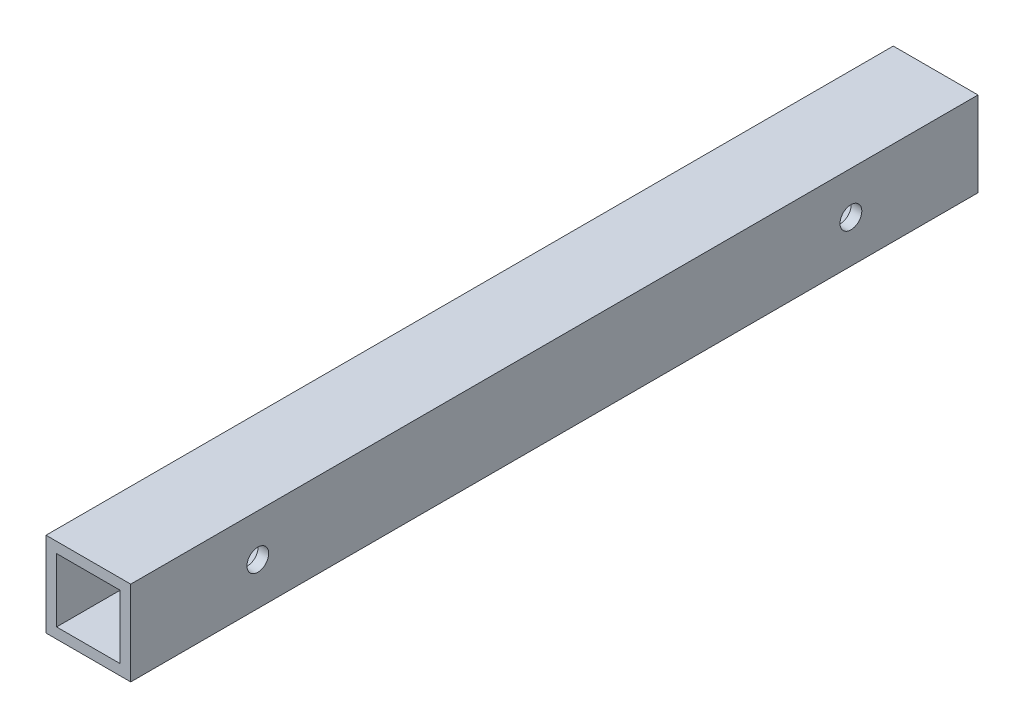
ISO-10303-21;
HEADER;
FILE_DESCRIPTION(('STEP AP214'),'2;1');
FILE_NAME('part.step','',(''),(''),'','','');
FILE_SCHEMA(('AUTOMOTIVE_DESIGN { 1 0 10303 214 1 1 1 1 }'));
ENDSEC;
DATA;
#1=APPLICATION_CONTEXT('core data for automotive mechanical design processes');
#2=APPLICATION_PROTOCOL_DEFINITION('international standard','automotive_design',2000,#1);
#3=PRODUCT_CONTEXT('',#1,'mechanical');
#4=PRODUCT('Part','Part','',(#3));
#5=PRODUCT_RELATED_PRODUCT_CATEGORY('part','',(#4));
#6=PRODUCT_DEFINITION_FORMATION('','',#4);
#7=PRODUCT_DEFINITION_CONTEXT('part definition',#1,'design');
#8=PRODUCT_DEFINITION('design','',#6,#7);
#9=PRODUCT_DEFINITION_SHAPE('','',#8);
#10=(LENGTH_UNIT() NAMED_UNIT(*) SI_UNIT(.MILLI.,.METRE.));
#11=(NAMED_UNIT(*) PLANE_ANGLE_UNIT() SI_UNIT($,.RADIAN.));
#12=(NAMED_UNIT(*) SI_UNIT($,.STERADIAN.) SOLID_ANGLE_UNIT());
#13=UNCERTAINTY_MEASURE_WITH_UNIT(LENGTH_MEASURE(1.E-05),#10,'distance_accuracy_value','');
#14=(GEOMETRIC_REPRESENTATION_CONTEXT(3) GLOBAL_UNCERTAINTY_ASSIGNED_CONTEXT((#13)) GLOBAL_UNIT_ASSIGNED_CONTEXT((#10,
#11,#12)) REPRESENTATION_CONTEXT('',''));
#15=CARTESIAN_POINT('',(0.,0.,0.));
#16=DIRECTION('',(0.,0.,1.));
#17=DIRECTION('',(1.,0.,0.));
#18=AXIS2_PLACEMENT_3D('',#15,#16,#17);
#19=CARTESIAN_POINT('',(0.,0.,254.));
#20=DIRECTION('',(0.,0.,-1.));
#21=DIRECTION('',(-1.,0.,0.));
#22=AXIS2_PLACEMENT_3D('',#19,#20,#21);
#23=PLANE('',#22);
#24=DIRECTION('',(0.,1.,0.));
#25=VECTOR('',#24,1.);
#26=CARTESIAN_POINT('',(12.7,-12.7,254.));
#27=LINE('',#26,#25);
#28=CARTESIAN_POINT('',(12.7,-12.7,254.));
#29=VERTEX_POINT('',#28);
#30=CARTESIAN_POINT('',(12.7,12.7,254.));
#31=VERTEX_POINT('',#30);
#32=EDGE_CURVE('E139',#29,#31,#27,.T.);
#33=ORIENTED_EDGE('',*,*,#32,.T.);
#34=DIRECTION('',(-1.,0.,0.));
#35=VECTOR('',#34,1.);
#36=CARTESIAN_POINT('',(-12.7,12.7,254.));
#37=LINE('',#36,#35);
#38=CARTESIAN_POINT('',(-12.7,12.7,254.));
#39=VERTEX_POINT('',#38);
#40=EDGE_CURVE('E142',#31,#39,#37,.T.);
#41=ORIENTED_EDGE('',*,*,#40,.T.);
#42=DIRECTION('',(0.,-1.,0.));
#43=VECTOR('',#42,1.);
#44=CARTESIAN_POINT('',(-12.7,-12.7,254.));
#45=LINE('',#44,#43);
#46=CARTESIAN_POINT('',(-12.7,-12.7,254.));
#47=VERTEX_POINT('',#46);
#48=EDGE_CURVE('E145',#39,#47,#45,.T.);
#49=ORIENTED_EDGE('',*,*,#48,.T.);
#50=DIRECTION('',(1.,0.,0.));
#51=VECTOR('',#50,1.);
#52=CARTESIAN_POINT('',(-12.7,-12.7,254.));
#53=LINE('',#52,#51);
#54=EDGE_CURVE('E147',#47,#29,#53,.T.);
#55=ORIENTED_EDGE('',*,*,#54,.T.);
#56=EDGE_LOOP('',(#33,#41,#49,#55));
#57=FACE_BOUND('',#56,.T.);
#58=DIRECTION('',(0.,-1.,0.));
#59=VECTOR('',#58,1.);
#60=CARTESIAN_POINT('',(-9.525,-9.525,254.));
#61=LINE('',#60,#59);
#62=CARTESIAN_POINT('',(-9.525,9.525,254.));
#63=VERTEX_POINT('',#62);
#64=CARTESIAN_POINT('',(-9.525,-9.525,254.));
#65=VERTEX_POINT('',#64);
#66=EDGE_CURVE('E101',#63,#65,#61,.T.);
#67=ORIENTED_EDGE('',*,*,#66,.F.);
#68=DIRECTION('',(-1.,0.,0.));
#69=VECTOR('',#68,1.);
#70=CARTESIAN_POINT('',(-9.525,9.525,254.));
#71=LINE('',#70,#69);
#72=CARTESIAN_POINT('',(9.525,9.525,254.));
#73=VERTEX_POINT('',#72);
#74=EDGE_CURVE('E123',#73,#63,#71,.T.);
#75=ORIENTED_EDGE('',*,*,#74,.F.);
#76=DIRECTION('',(0.,1.,0.));
#77=VECTOR('',#76,1.);
#78=CARTESIAN_POINT('',(9.525,-9.525,254.));
#79=LINE('',#78,#77);
#80=CARTESIAN_POINT('',(9.525,-9.525,254.));
#81=VERTEX_POINT('',#80);
#82=EDGE_CURVE('E121',#81,#73,#79,.T.);
#83=ORIENTED_EDGE('',*,*,#82,.F.);
#84=DIRECTION('',(1.,0.,0.));
#85=VECTOR('',#84,1.);
#86=CARTESIAN_POINT('',(-9.525,-9.525,254.));
#87=LINE('',#86,#85);
#88=EDGE_CURVE('E109',#65,#81,#87,.T.);
#89=ORIENTED_EDGE('',*,*,#88,.F.);
#90=EDGE_LOOP('',(#67,#75,#83,#89));
#91=FACE_BOUND('',#90,.T.);
#92=ADVANCED_FACE('F34',(#57,#91),#23,.F.);
#93=CARTESIAN_POINT('',(0.,0.,0.));
#94=DIRECTION('',(0.,0.,-1.));
#95=DIRECTION('',(-1.,0.,0.));
#96=AXIS2_PLACEMENT_3D('',#93,#94,#95);
#97=PLANE('',#96);
#98=DIRECTION('',(0.,1.,0.));
#99=VECTOR('',#98,1.);
#100=CARTESIAN_POINT('',(12.7,-12.7,0.));
#101=LINE('',#100,#99);
#102=CARTESIAN_POINT('',(12.7,-12.7,0.));
#103=VERTEX_POINT('',#102);
#104=CARTESIAN_POINT('',(12.7,12.7,0.));
#105=VERTEX_POINT('',#104);
#106=EDGE_CURVE('E117',#103,#105,#101,.T.);
#107=ORIENTED_EDGE('',*,*,#106,.F.);
#108=DIRECTION('',(1.,0.,0.));
#109=VECTOR('',#108,1.);
#110=CARTESIAN_POINT('',(-12.7,-12.7,0.));
#111=LINE('',#110,#109);
#112=CARTESIAN_POINT('',(-12.7,-12.7,0.));
#113=VERTEX_POINT('',#112);
#114=EDGE_CURVE('E143',#113,#103,#111,.T.);
#115=ORIENTED_EDGE('',*,*,#114,.F.);
#116=DIRECTION('',(0.,-1.,0.));
#117=VECTOR('',#116,1.);
#118=CARTESIAN_POINT('',(-12.7,-12.7,0.));
#119=LINE('',#118,#117);
#120=CARTESIAN_POINT('',(-12.7,12.7,0.));
#121=VERTEX_POINT('',#120);
#122=EDGE_CURVE('E154',#121,#113,#119,.T.);
#123=ORIENTED_EDGE('',*,*,#122,.F.);
#124=DIRECTION('',(-1.,0.,0.));
#125=VECTOR('',#124,1.);
#126=CARTESIAN_POINT('',(-12.7,12.7,0.));
#127=LINE('',#126,#125);
#128=EDGE_CURVE('E152',#105,#121,#127,.T.);
#129=ORIENTED_EDGE('',*,*,#128,.F.);
#130=EDGE_LOOP('',(#107,#115,#123,#129));
#131=FACE_BOUND('',#130,.T.);
#132=DIRECTION('',(-1.,0.,0.));
#133=VECTOR('',#132,1.);
#134=CARTESIAN_POINT('',(-9.525,9.525,0.));
#135=LINE('',#134,#133);
#136=CARTESIAN_POINT('',(9.525,9.525,0.));
#137=VERTEX_POINT('',#136);
#138=CARTESIAN_POINT('',(-9.525,9.525,0.));
#139=VERTEX_POINT('',#138);
#140=EDGE_CURVE('E110',#137,#139,#135,.T.);
#141=ORIENTED_EDGE('',*,*,#140,.T.);
#142=DIRECTION('',(0.,-1.,0.));
#143=VECTOR('',#142,1.);
#144=CARTESIAN_POINT('',(-9.525,-9.525,0.));
#145=LINE('',#144,#143);
#146=CARTESIAN_POINT('',(-9.525,-9.525,0.));
#147=VERTEX_POINT('',#146);
#148=EDGE_CURVE('E59',#139,#147,#145,.T.);
#149=ORIENTED_EDGE('',*,*,#148,.T.);
#150=DIRECTION('',(1.,0.,0.));
#151=VECTOR('',#150,1.);
#152=CARTESIAN_POINT('',(-9.525,-9.525,0.));
#153=LINE('',#152,#151);
#154=CARTESIAN_POINT('',(9.525,-9.525,0.));
#155=VERTEX_POINT('',#154);
#156=EDGE_CURVE('E116',#147,#155,#153,.T.);
#157=ORIENTED_EDGE('',*,*,#156,.T.);
#158=DIRECTION('',(0.,1.,0.));
#159=VECTOR('',#158,1.);
#160=CARTESIAN_POINT('',(9.525,-9.525,0.));
#161=LINE('',#160,#159);
#162=EDGE_CURVE('E131',#155,#137,#161,.T.);
#163=ORIENTED_EDGE('',*,*,#162,.T.);
#164=EDGE_LOOP('',(#141,#149,#157,#163));
#165=FACE_BOUND('',#164,.T.);
#166=ADVANCED_FACE('F192',(#131,#165),#97,.T.);
#167=CARTESIAN_POINT('',(12.7,-12.7,254.));
#168=DIRECTION('',(-1.,0.,0.));
#169=DIRECTION('',(0.,0.,1.));
#170=AXIS2_PLACEMENT_3D('',#167,#168,#169);
#171=PLANE('',#170);
#172=CARTESIAN_POINT('',(12.7,0.,215.9));
#173=DIRECTION('',(1.,0.,0.));
#174=DIRECTION('',(0.,0.,-1.));
#175=AXIS2_PLACEMENT_3D('',#172,#173,#174);
#176=CIRCLE('',#175,3.2639);
#177=CARTESIAN_POINT('',(12.7,0.,212.6361));
#178=VERTEX_POINT('',#177);
#179=EDGE_CURVE('E183',#178,#178,#176,.T.);
#180=ORIENTED_EDGE('',*,*,#179,.F.);
#181=EDGE_LOOP('',(#180));
#182=FACE_BOUND('',#181,.T.);
#183=CARTESIAN_POINT('',(12.7,0.,38.1));
#184=DIRECTION('',(1.,0.,0.));
#185=DIRECTION('',(0.,0.,-1.));
#186=AXIS2_PLACEMENT_3D('',#183,#184,#185);
#187=CIRCLE('',#186,3.2639);
#188=CARTESIAN_POINT('',(12.7,0.,34.8361));
#189=VERTEX_POINT('',#188);
#190=EDGE_CURVE('E170',#189,#189,#187,.T.);
#191=ORIENTED_EDGE('',*,*,#190,.F.);
#192=EDGE_LOOP('',(#191));
#193=FACE_BOUND('',#192,.T.);
#194=ORIENTED_EDGE('',*,*,#106,.T.);
#195=DIRECTION('',(0.,0.,-1.));
#196=VECTOR('',#195,1.);
#197=CARTESIAN_POINT('',(12.7,12.7,254.));
#198=LINE('',#197,#196);
#199=EDGE_CURVE('E11',#31,#105,#198,.T.);
#200=ORIENTED_EDGE('',*,*,#199,.F.);
#201=ORIENTED_EDGE('',*,*,#32,.F.);
#202=DIRECTION('',(0.,0.,-1.));
#203=VECTOR('',#202,1.);
#204=CARTESIAN_POINT('',(12.7,-12.7,254.));
#205=LINE('',#204,#203);
#206=EDGE_CURVE('E149',#29,#103,#205,.T.);
#207=ORIENTED_EDGE('',*,*,#206,.T.);
#208=EDGE_LOOP('',(#194,#200,#201,#207));
#209=FACE_BOUND('',#208,.T.);
#210=ADVANCED_FACE('F36',(#182,#193,#209),#171,.F.);
#211=CARTESIAN_POINT('',(-12.7,12.7,254.));
#212=DIRECTION('',(0.,-1.,0.));
#213=DIRECTION('',(0.,0.,-1.));
#214=AXIS2_PLACEMENT_3D('',#211,#212,#213);
#215=PLANE('',#214);
#216=ORIENTED_EDGE('',*,*,#128,.T.);
#217=DIRECTION('',(0.,0.,-1.));
#218=VECTOR('',#217,1.);
#219=CARTESIAN_POINT('',(-12.7,12.7,254.));
#220=LINE('',#219,#218);
#221=EDGE_CURVE('E43',#39,#121,#220,.T.);
#222=ORIENTED_EDGE('',*,*,#221,.F.);
#223=ORIENTED_EDGE('',*,*,#40,.F.);
#224=ORIENTED_EDGE('',*,*,#199,.T.);
#225=EDGE_LOOP('',(#216,#222,#223,#224));
#226=FACE_BOUND('',#225,.T.);
#227=ADVANCED_FACE('F191',(#226),#215,.F.);
#228=CARTESIAN_POINT('',(-12.7,-12.7,254.));
#229=DIRECTION('',(1.,0.,0.));
#230=DIRECTION('',(0.,0.,-1.));
#231=AXIS2_PLACEMENT_3D('',#228,#229,#230);
#232=PLANE('',#231);
#233=CARTESIAN_POINT('',(-12.7,0.,215.9));
#234=DIRECTION('',(1.,0.,0.));
#235=DIRECTION('',(0.,0.,-1.));
#236=AXIS2_PLACEMENT_3D('',#233,#234,#235);
#237=CIRCLE('',#236,3.26389999999999);
#238=CARTESIAN_POINT('',(-12.7,0.,212.6361));
#239=VERTEX_POINT('',#238);
#240=EDGE_CURVE('E180',#239,#239,#237,.T.);
#241=ORIENTED_EDGE('',*,*,#240,.T.);
#242=EDGE_LOOP('',(#241));
#243=FACE_BOUND('',#242,.T.);
#244=CARTESIAN_POINT('',(-12.7,0.,38.1));
#245=DIRECTION('',(1.,0.,0.));
#246=DIRECTION('',(0.,0.,-1.));
#247=AXIS2_PLACEMENT_3D('',#244,#245,#246);
#248=CIRCLE('',#247,3.26389999999999);
#249=CARTESIAN_POINT('',(-12.7,0.,34.8361));
#250=VERTEX_POINT('',#249);
#251=EDGE_CURVE('E165',#250,#250,#248,.T.);
#252=ORIENTED_EDGE('',*,*,#251,.T.);
#253=EDGE_LOOP('',(#252));
#254=FACE_BOUND('',#253,.T.);
#255=ORIENTED_EDGE('',*,*,#122,.T.);
#256=DIRECTION('',(0.,0.,-1.));
#257=VECTOR('',#256,1.);
#258=CARTESIAN_POINT('',(-12.7,-12.7,254.));
#259=LINE('',#258,#257);
#260=EDGE_CURVE('E159',#47,#113,#259,.T.);
#261=ORIENTED_EDGE('',*,*,#260,.F.);
#262=ORIENTED_EDGE('',*,*,#48,.F.);
#263=ORIENTED_EDGE('',*,*,#221,.T.);
#264=EDGE_LOOP('',(#255,#261,#262,#263));
#265=FACE_BOUND('',#264,.T.);
#266=ADVANCED_FACE('F212',(#243,#254,#265),#232,.F.);
#267=CARTESIAN_POINT('',(-12.7,-12.7,254.));
#268=DIRECTION('',(0.,1.,0.));
#269=DIRECTION('',(0.,0.,1.));
#270=AXIS2_PLACEMENT_3D('',#267,#268,#269);
#271=PLANE('',#270);
#272=ORIENTED_EDGE('',*,*,#114,.T.);
#273=ORIENTED_EDGE('',*,*,#206,.F.);
#274=ORIENTED_EDGE('',*,*,#54,.F.);
#275=ORIENTED_EDGE('',*,*,#260,.T.);
#276=EDGE_LOOP('',(#272,#273,#274,#275));
#277=FACE_BOUND('',#276,.T.);
#278=ADVANCED_FACE('F210',(#277),#271,.F.);
#279=CARTESIAN_POINT('',(-9.525,-9.525,254.));
#280=DIRECTION('',(1.,0.,0.));
#281=DIRECTION('',(0.,0.,-1.));
#282=AXIS2_PLACEMENT_3D('',#279,#280,#281);
#283=PLANE('',#282);
#284=CARTESIAN_POINT('',(-9.525,0.,215.9));
#285=DIRECTION('',(1.,0.,0.));
#286=DIRECTION('',(0.,0.,-1.));
#287=AXIS2_PLACEMENT_3D('',#284,#285,#286);
#288=CIRCLE('',#287,3.2639);
#289=CARTESIAN_POINT('',(-9.525,0.,212.6361));
#290=VERTEX_POINT('',#289);
#291=EDGE_CURVE('E175',#290,#290,#288,.T.);
#292=ORIENTED_EDGE('',*,*,#291,.F.);
#293=EDGE_LOOP('',(#292));
#294=FACE_BOUND('',#293,.T.);
#295=CARTESIAN_POINT('',(-9.525,0.,38.1));
#296=DIRECTION('',(1.,0.,0.));
#297=DIRECTION('',(0.,0.,-1.));
#298=AXIS2_PLACEMENT_3D('',#295,#296,#297);
#299=CIRCLE('',#298,3.2639);
#300=CARTESIAN_POINT('',(-9.525,0.,34.8361));
#301=VERTEX_POINT('',#300);
#302=EDGE_CURVE('E129',#301,#301,#299,.T.);
#303=ORIENTED_EDGE('',*,*,#302,.F.);
#304=EDGE_LOOP('',(#303));
#305=FACE_BOUND('',#304,.T.);
#306=ORIENTED_EDGE('',*,*,#148,.F.);
#307=DIRECTION('',(0.,0.,-1.));
#308=VECTOR('',#307,1.);
#309=CARTESIAN_POINT('',(-9.525,9.525,254.));
#310=LINE('',#309,#308);
#311=EDGE_CURVE('E105',#63,#139,#310,.T.);
#312=ORIENTED_EDGE('',*,*,#311,.F.);
#313=ORIENTED_EDGE('',*,*,#66,.T.);
#314=DIRECTION('',(0.,0.,-1.));
#315=VECTOR('',#314,1.);
#316=CARTESIAN_POINT('',(-9.525,-9.525,254.));
#317=LINE('',#316,#315);
#318=EDGE_CURVE('E104',#65,#147,#317,.T.);
#319=ORIENTED_EDGE('',*,*,#318,.T.);
#320=EDGE_LOOP('',(#306,#312,#313,#319));
#321=FACE_BOUND('',#320,.T.);
#322=ADVANCED_FACE('F103',(#294,#305,#321),#283,.T.);
#323=CARTESIAN_POINT('',(-9.525,-9.525,254.));
#324=DIRECTION('',(0.,1.,0.));
#325=DIRECTION('',(0.,0.,1.));
#326=AXIS2_PLACEMENT_3D('',#323,#324,#325);
#327=PLANE('',#326);
#328=ORIENTED_EDGE('',*,*,#156,.F.);
#329=ORIENTED_EDGE('',*,*,#318,.F.);
#330=ORIENTED_EDGE('',*,*,#88,.T.);
#331=DIRECTION('',(0.,0.,-1.));
#332=VECTOR('',#331,1.);
#333=CARTESIAN_POINT('',(9.525,-9.525,254.));
#334=LINE('',#333,#332);
#335=EDGE_CURVE('E118',#81,#155,#334,.T.);
#336=ORIENTED_EDGE('',*,*,#335,.T.);
#337=EDGE_LOOP('',(#328,#329,#330,#336));
#338=FACE_BOUND('',#337,.T.);
#339=ADVANCED_FACE('F113',(#338),#327,.T.);
#340=CARTESIAN_POINT('',(9.525,-9.525,254.));
#341=DIRECTION('',(-1.,0.,0.));
#342=DIRECTION('',(0.,-1.,0.));
#343=AXIS2_PLACEMENT_3D('',#340,#341,#342);
#344=PLANE('',#343);
#345=CARTESIAN_POINT('',(9.525,0.,215.9));
#346=DIRECTION('',(-1.,0.,0.));
#347=DIRECTION('',(0.,-1.,0.));
#348=AXIS2_PLACEMENT_3D('',#345,#346,#347);
#349=CIRCLE('',#348,3.2639);
#350=CARTESIAN_POINT('',(9.525,-3.2639,215.9));
#351=VERTEX_POINT('',#350);
#352=EDGE_CURVE('E38',#351,#351,#349,.T.);
#353=ORIENTED_EDGE('',*,*,#352,.F.);
#354=EDGE_LOOP('',(#353));
#355=FACE_BOUND('',#354,.T.);
#356=CARTESIAN_POINT('',(9.525,0.,38.1));
#357=DIRECTION('',(-1.,0.,0.));
#358=DIRECTION('',(0.,-1.,0.));
#359=AXIS2_PLACEMENT_3D('',#356,#357,#358);
#360=CIRCLE('',#359,3.2639);
#361=CARTESIAN_POINT('',(9.525,-3.2639,38.1));
#362=VERTEX_POINT('',#361);
#363=EDGE_CURVE('E163',#362,#362,#360,.T.);
#364=ORIENTED_EDGE('',*,*,#363,.F.);
#365=EDGE_LOOP('',(#364));
#366=FACE_BOUND('',#365,.T.);
#367=ORIENTED_EDGE('',*,*,#162,.F.);
#368=ORIENTED_EDGE('',*,*,#335,.F.);
#369=ORIENTED_EDGE('',*,*,#82,.T.);
#370=DIRECTION('',(0.,0.,-1.));
#371=VECTOR('',#370,1.);
#372=CARTESIAN_POINT('',(9.525,9.525,254.));
#373=LINE('',#372,#371);
#374=EDGE_CURVE('E51',#73,#137,#373,.T.);
#375=ORIENTED_EDGE('',*,*,#374,.T.);
#376=EDGE_LOOP('',(#367,#368,#369,#375));
#377=FACE_BOUND('',#376,.T.);
#378=ADVANCED_FACE('F233',(#355,#366,#377),#344,.T.);
#379=CARTESIAN_POINT('',(-9.525,9.525,254.));
#380=DIRECTION('',(0.,-1.,0.));
#381=DIRECTION('',(0.,0.,-1.));
#382=AXIS2_PLACEMENT_3D('',#379,#380,#381);
#383=PLANE('',#382);
#384=ORIENTED_EDGE('',*,*,#140,.F.);
#385=ORIENTED_EDGE('',*,*,#374,.F.);
#386=ORIENTED_EDGE('',*,*,#74,.T.);
#387=ORIENTED_EDGE('',*,*,#311,.T.);
#388=EDGE_LOOP('',(#384,#385,#386,#387));
#389=FACE_BOUND('',#388,.T.);
#390=ADVANCED_FACE('F236',(#389),#383,.T.);
#391=CARTESIAN_POINT('',(12.7,0.,38.1));
#392=DIRECTION('',(1.,0.,0.));
#393=DIRECTION('',(0.,0.,-1.));
#394=AXIS2_PLACEMENT_3D('',#391,#392,#393);
#395=CYLINDRICAL_SURFACE('',#394,3.2639);
#396=ORIENTED_EDGE('',*,*,#363,.T.);
#397=EDGE_LOOP('',(#396));
#398=FACE_BOUND('',#397,.T.);
#399=ORIENTED_EDGE('',*,*,#190,.T.);
#400=EDGE_LOOP('',(#399));
#401=FACE_BOUND('',#400,.T.);
#402=ADVANCED_FACE('F240',(#398,#401),#395,.F.);
#403=ORIENTED_EDGE('',*,*,#302,.T.);
#404=EDGE_LOOP('',(#403));
#405=FACE_BOUND('',#404,.T.);
#406=ORIENTED_EDGE('',*,*,#251,.F.);
#407=EDGE_LOOP('',(#406));
#408=FACE_BOUND('',#407,.T.);
#409=ADVANCED_FACE('F243',(#405,#408),#395,.F.);
#410=CARTESIAN_POINT('',(12.7,0.,215.9));
#411=DIRECTION('',(1.,0.,0.));
#412=DIRECTION('',(0.,0.,-1.));
#413=AXIS2_PLACEMENT_3D('',#410,#411,#412);
#414=CYLINDRICAL_SURFACE('',#413,3.2639);
#415=ORIENTED_EDGE('',*,*,#352,.T.);
#416=EDGE_LOOP('',(#415));
#417=FACE_BOUND('',#416,.T.);
#418=ORIENTED_EDGE('',*,*,#179,.T.);
#419=EDGE_LOOP('',(#418));
#420=FACE_BOUND('',#419,.T.);
#421=ADVANCED_FACE('F187',(#417,#420),#414,.F.);
#422=ORIENTED_EDGE('',*,*,#291,.T.);
#423=EDGE_LOOP('',(#422));
#424=FACE_BOUND('',#423,.T.);
#425=ORIENTED_EDGE('',*,*,#240,.F.);
#426=EDGE_LOOP('',(#425));
#427=FACE_BOUND('',#426,.T.);
#428=ADVANCED_FACE('F245',(#424,#427),#414,.F.);
#429=CLOSED_SHELL('',(#92,#166,#210,#227,#266,#278,#322,#339,#378,#390,#402,#409,#421,#428));
#430=MANIFOLD_SOLID_BREP('B2',#429);
#431=ADVANCED_BREP_SHAPE_REPRESENTATION('',(#18,#430),#14);
#432=SHAPE_DEFINITION_REPRESENTATION(#9,#431);
ENDSEC;
END-ISO-10303-21;
